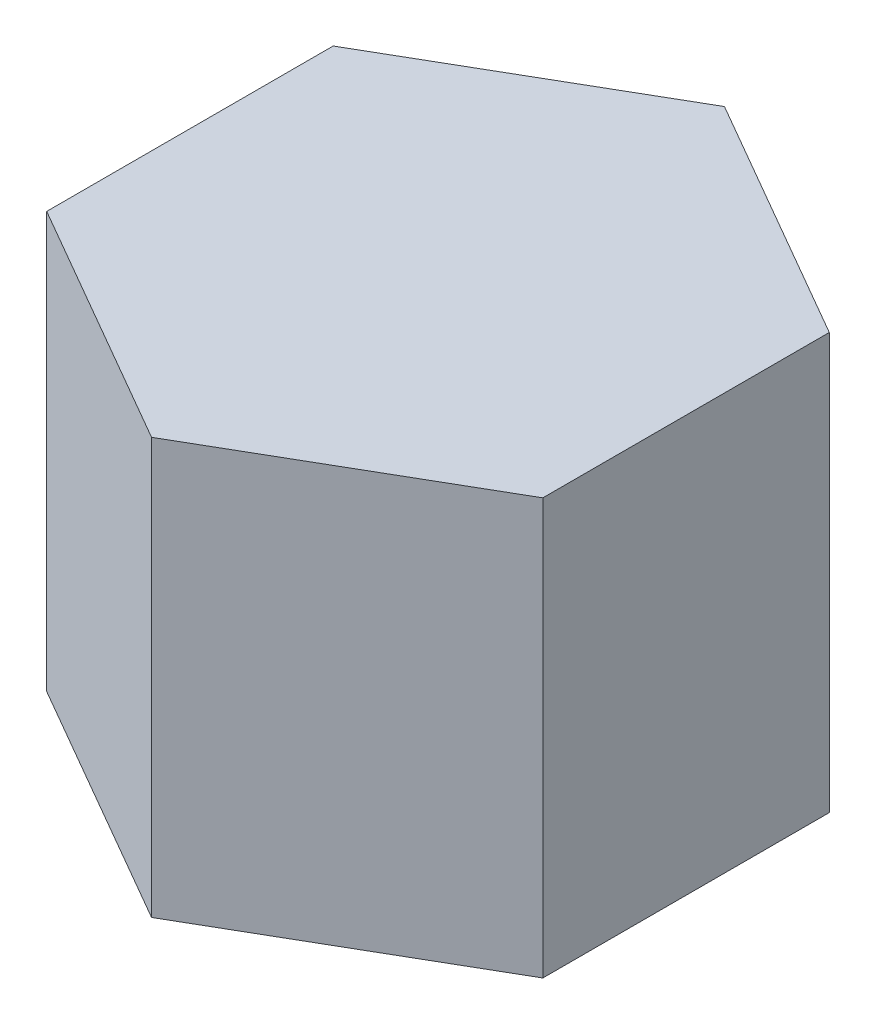
ISO-10303-21;
HEADER;
FILE_DESCRIPTION(('STEP AP214'),'2;1');
FILE_NAME('part.step','',(''),(''),'','','');
FILE_SCHEMA(('AUTOMOTIVE_DESIGN { 1 0 10303 214 1 1 1 1 }'));
ENDSEC;
DATA;
#1=APPLICATION_CONTEXT('core data for automotive mechanical design processes');
#2=APPLICATION_PROTOCOL_DEFINITION('international standard','automotive_design',2000,#1);
#3=PRODUCT_CONTEXT('',#1,'mechanical');
#4=PRODUCT('Part','Part','',(#3));
#5=PRODUCT_RELATED_PRODUCT_CATEGORY('part','',(#4));
#6=PRODUCT_DEFINITION_FORMATION('','',#4);
#7=PRODUCT_DEFINITION_CONTEXT('part definition',#1,'design');
#8=PRODUCT_DEFINITION('design','',#6,#7);
#9=PRODUCT_DEFINITION_SHAPE('','',#8);
#10=(LENGTH_UNIT() NAMED_UNIT(*) SI_UNIT(.MILLI.,.METRE.));
#11=(NAMED_UNIT(*) PLANE_ANGLE_UNIT() SI_UNIT($,.RADIAN.));
#12=(NAMED_UNIT(*) SI_UNIT($,.STERADIAN.) SOLID_ANGLE_UNIT());
#13=UNCERTAINTY_MEASURE_WITH_UNIT(LENGTH_MEASURE(1.E-05),#10,'distance_accuracy_value','');
#14=(GEOMETRIC_REPRESENTATION_CONTEXT(3) GLOBAL_UNCERTAINTY_ASSIGNED_CONTEXT((#13)) GLOBAL_UNIT_ASSIGNED_CONTEXT((#10,
#11,#12)) REPRESENTATION_CONTEXT('',''));
#15=CARTESIAN_POINT('',(0.,0.,0.));
#16=DIRECTION('',(0.,0.,1.));
#17=DIRECTION('',(1.,0.,0.));
#18=AXIS2_PLACEMENT_3D('',#15,#16,#17);
#19=CARTESIAN_POINT('',(205.642660308706,-148.537700895744,293.239022028063));
#20=DIRECTION('',(-0.499999999999909,0.,-0.866025403784491));
#21=DIRECTION('',(-0.866025403784491,0.,0.499999999999909));
#22=AXIS2_PLACEMENT_3D('',#19,#20,#21);
#23=PLANE('',#22);
#24=CARTESIAN_POINT('',(205.339551417382,-149.045793579175,293.414022028063));
#25=DIRECTION('',(0.866025403784491,0.,-0.499999999999909));
#26=VECTOR('',#25,1.);
#27=LINE('',#24,#26);
#28=CARTESIAN_POINT('',(205.339551417382,-149.045793579175,293.414022028063));
#29=VERTEX_POINT('',#28);
#30=CARTESIAN_POINT('',(205.642660308706,-149.045793579175,293.239022028063));
#31=VERTEX_POINT('',#30);
#32=EDGE_CURVE('E170',#29,#31,#27,.T.);
#33=ORIENTED_EDGE('',*,*,#32,.T.);
#34=CARTESIAN_POINT('',(205.642660308706,-148.537700895744,293.239022028063));
#35=DIRECTION('',(0.,-1.,0.));
#36=VECTOR('',#35,1.);
#37=LINE('',#34,#36);
#38=CARTESIAN_POINT('',(205.642660308706,-148.537700895744,293.239022028063));
#39=VERTEX_POINT('',#38);
#40=EDGE_CURVE('E35',#39,#31,#37,.T.);
#41=ORIENTED_EDGE('',*,*,#40,.F.);
#42=CARTESIAN_POINT('',(205.339551417382,-148.537700895744,293.414022028063));
#43=DIRECTION('',(0.866025403784491,0.,-0.499999999999909));
#44=VECTOR('',#43,1.);
#45=LINE('',#42,#44);
#46=CARTESIAN_POINT('',(205.339551417382,-148.537700895744,293.414022028063));
#47=VERTEX_POINT('',#46);
#48=EDGE_CURVE('E159',#47,#39,#45,.T.);
#49=ORIENTED_EDGE('',*,*,#48,.F.);
#50=CARTESIAN_POINT('',(205.339551417382,-148.537700895744,293.414022028063));
#51=DIRECTION('',(0.,-1.,0.));
#52=VECTOR('',#51,1.);
#53=LINE('',#50,#52);
#54=EDGE_CURVE('E10',#47,#29,#53,.T.);
#55=ORIENTED_EDGE('',*,*,#54,.T.);
#56=EDGE_LOOP('',(#33,#41,#49,#55));
#57=FACE_BOUND('',#56,.T.);
#58=ADVANCED_FACE('F16',(#57),#23,.F.);
#59=CARTESIAN_POINT('',(205.339551417382,-148.537700895744,293.414022028063));
#60=DIRECTION('',(0.500000000000062,0.,-0.866025403784403));
#61=DIRECTION('',(-0.866025403784403,0.,-0.500000000000062));
#62=AXIS2_PLACEMENT_3D('',#59,#60,#61);
#63=PLANE('',#62);
#64=CARTESIAN_POINT('',(205.036442526057,-149.045793579175,293.239022028063));
#65=DIRECTION('',(0.866025403784403,0.,0.500000000000062));
#66=VECTOR('',#65,1.);
#67=LINE('',#64,#66);
#68=CARTESIAN_POINT('',(205.036442526057,-149.045793579175,293.239022028063));
#69=VERTEX_POINT('',#68);
#70=EDGE_CURVE('E167',#69,#29,#67,.T.);
#71=ORIENTED_EDGE('',*,*,#70,.T.);
#72=ORIENTED_EDGE('',*,*,#54,.F.);
#73=CARTESIAN_POINT('',(205.036442526057,-148.537700895744,293.239022028063));
#74=DIRECTION('',(0.866025403784403,0.,0.500000000000062));
#75=VECTOR('',#74,1.);
#76=LINE('',#73,#75);
#77=CARTESIAN_POINT('',(205.036442526057,-148.537700895744,293.239022028063));
#78=VERTEX_POINT('',#77);
#79=EDGE_CURVE('E156',#78,#47,#76,.T.);
#80=ORIENTED_EDGE('',*,*,#79,.F.);
#81=CARTESIAN_POINT('',(205.036442526057,-148.537700895744,293.239022028063));
#82=DIRECTION('',(0.,-1.,0.));
#83=VECTOR('',#82,1.);
#84=LINE('',#81,#83);
#85=EDGE_CURVE('E27',#78,#69,#84,.T.);
#86=ORIENTED_EDGE('',*,*,#85,.T.);
#87=EDGE_LOOP('',(#71,#72,#80,#86));
#88=FACE_BOUND('',#87,.T.);
#89=ADVANCED_FACE('F189',(#88),#63,.F.);
#90=CARTESIAN_POINT('',(205.036442526057,-148.537700895744,290.831971220494));
#91=DIRECTION('',(1.,0.,0.));
#92=DIRECTION('',(0.,1.,0.));
#93=AXIS2_PLACEMENT_3D('',#90,#91,#92);
#94=PLANE('',#93);
#95=CARTESIAN_POINT('',(205.036442526057,-149.045793579175,292.889022028063));
#96=DIRECTION('',(0.,0.,1.));
#97=VECTOR('',#96,1.);
#98=LINE('',#95,#97);
#99=CARTESIAN_POINT('',(205.036442526057,-149.045793579175,292.889022028063));
#100=VERTEX_POINT('',#99);
#101=EDGE_CURVE('E163',#100,#69,#98,.T.);
#102=ORIENTED_EDGE('',*,*,#101,.T.);
#103=ORIENTED_EDGE('',*,*,#85,.F.);
#104=CARTESIAN_POINT('',(205.036442526057,-148.537700895744,292.889022028063));
#105=DIRECTION('',(0.,0.,1.));
#106=VECTOR('',#105,1.);
#107=LINE('',#104,#106);
#108=CARTESIAN_POINT('',(205.036442526057,-148.537700895744,292.889022028063));
#109=VERTEX_POINT('',#108);
#110=EDGE_CURVE('E106',#109,#78,#107,.T.);
#111=ORIENTED_EDGE('',*,*,#110,.F.);
#112=CARTESIAN_POINT('',(205.036442526057,-148.537700895744,292.889022028063));
#113=DIRECTION('',(0.,-1.,0.));
#114=VECTOR('',#113,1.);
#115=LINE('',#112,#114);
#116=EDGE_CURVE('E94',#109,#100,#115,.T.);
#117=ORIENTED_EDGE('',*,*,#116,.T.);
#118=EDGE_LOOP('',(#102,#103,#111,#117));
#119=FACE_BOUND('',#118,.T.);
#120=ADVANCED_FACE('F198',(#119),#94,.F.);
#121=CARTESIAN_POINT('',(205.036442526057,-148.537700895744,292.889022028063));
#122=DIRECTION('',(0.499999999999943,0.,0.866025403784472));
#123=DIRECTION('',(0.866025403784472,0.,-0.499999999999943));
#124=AXIS2_PLACEMENT_3D('',#121,#122,#123);
#125=PLANE('',#124);
#126=CARTESIAN_POINT('',(205.339551417382,-149.045793579175,292.714022028063));
#127=DIRECTION('',(-0.866025403784471,0.,0.499999999999943));
#128=VECTOR('',#127,1.);
#129=LINE('',#126,#128);
#130=CARTESIAN_POINT('',(205.339551417382,-149.045793579175,292.714022028063));
#131=VERTEX_POINT('',#130);
#132=EDGE_CURVE('E162',#131,#100,#129,.T.);
#133=ORIENTED_EDGE('',*,*,#132,.T.);
#134=ORIENTED_EDGE('',*,*,#116,.F.);
#135=CARTESIAN_POINT('',(205.339551417382,-148.537700895744,292.714022028063));
#136=DIRECTION('',(-0.866025403784471,0.,0.499999999999943));
#137=VECTOR('',#136,1.);
#138=LINE('',#135,#137);
#139=CARTESIAN_POINT('',(205.339551417382,-148.537700895744,292.714022028063));
#140=VERTEX_POINT('',#139);
#141=EDGE_CURVE('E98',#140,#109,#138,.T.);
#142=ORIENTED_EDGE('',*,*,#141,.F.);
#143=CARTESIAN_POINT('',(205.339551417382,-148.537700895744,292.714022028063));
#144=DIRECTION('',(0.,-1.,0.));
#145=VECTOR('',#144,1.);
#146=LINE('',#143,#145);
#147=EDGE_CURVE('E79',#140,#131,#146,.T.);
#148=ORIENTED_EDGE('',*,*,#147,.T.);
#149=EDGE_LOOP('',(#133,#134,#142,#148));
#150=FACE_BOUND('',#149,.T.);
#151=ADVANCED_FACE('F100',(#150),#125,.F.);
#152=CARTESIAN_POINT('',(205.339551417382,-148.537700895744,292.714022028063));
#153=DIRECTION('',(-0.500000000000096,0.,0.866025403784383));
#154=DIRECTION('',(0.866025403784383,0.,0.500000000000096));
#155=AXIS2_PLACEMENT_3D('',#152,#153,#154);
#156=PLANE('',#155);
#157=CARTESIAN_POINT('',(205.642660308706,-149.045793579175,292.889022028063));
#158=DIRECTION('',(-0.866025403784383,0.,-0.500000000000096));
#159=VECTOR('',#158,1.);
#160=LINE('',#157,#159);
#161=CARTESIAN_POINT('',(205.642660308706,-149.045793579175,292.889022028063));
#162=VERTEX_POINT('',#161);
#163=EDGE_CURVE('E88',#162,#131,#160,.T.);
#164=ORIENTED_EDGE('',*,*,#163,.T.);
#165=ORIENTED_EDGE('',*,*,#147,.F.);
#166=CARTESIAN_POINT('',(205.642660308706,-148.537700895744,292.889022028063));
#167=DIRECTION('',(-0.866025403784383,0.,-0.500000000000096));
#168=VECTOR('',#167,1.);
#169=LINE('',#166,#168);
#170=CARTESIAN_POINT('',(205.642660308706,-148.537700895744,292.889022028063));
#171=VERTEX_POINT('',#170);
#172=EDGE_CURVE('E84',#171,#140,#169,.T.);
#173=ORIENTED_EDGE('',*,*,#172,.F.);
#174=CARTESIAN_POINT('',(205.642660308706,-148.537700895744,292.889022028063));
#175=DIRECTION('',(0.,-1.,0.));
#176=VECTOR('',#175,1.);
#177=LINE('',#174,#176);
#178=EDGE_CURVE('E58',#171,#162,#177,.T.);
#179=ORIENTED_EDGE('',*,*,#178,.T.);
#180=EDGE_LOOP('',(#164,#165,#173,#179));
#181=FACE_BOUND('',#180,.T.);
#182=ADVANCED_FACE('F82',(#181),#156,.F.);
#183=CARTESIAN_POINT('',(205.642660308706,-148.537700895744,290.831971220494));
#184=DIRECTION('',(-1.,0.,0.));
#185=DIRECTION('',(0.,-1.,0.));
#186=AXIS2_PLACEMENT_3D('',#183,#184,#185);
#187=PLANE('',#186);
#188=CARTESIAN_POINT('',(205.642660308706,-149.045793579175,293.239022028063));
#189=DIRECTION('',(0.,0.,-1.));
#190=VECTOR('',#189,1.);
#191=LINE('',#188,#190);
#192=EDGE_CURVE('E160',#31,#162,#191,.T.);
#193=ORIENTED_EDGE('',*,*,#192,.T.);
#194=ORIENTED_EDGE('',*,*,#178,.F.);
#195=CARTESIAN_POINT('',(205.642660308706,-148.537700895744,293.239022028063));
#196=DIRECTION('',(0.,0.,-1.));
#197=VECTOR('',#196,1.);
#198=LINE('',#195,#197);
#199=EDGE_CURVE('E112',#39,#171,#198,.T.);
#200=ORIENTED_EDGE('',*,*,#199,.F.);
#201=ORIENTED_EDGE('',*,*,#40,.T.);
#202=EDGE_LOOP('',(#193,#194,#200,#201));
#203=FACE_BOUND('',#202,.T.);
#204=ADVANCED_FACE('F131',(#203),#187,.F.);
#205=CARTESIAN_POINT('',(206.339551417382,-148.537700895744,290.831971220494));
#206=DIRECTION('',(0.,-1.,0.));
#207=DIRECTION('',(1.,0.,0.));
#208=AXIS2_PLACEMENT_3D('',#205,#206,#207);
#209=PLANE('',#208);
#210=ORIENTED_EDGE('',*,*,#48,.T.);
#211=ORIENTED_EDGE('',*,*,#199,.T.);
#212=ORIENTED_EDGE('',*,*,#172,.T.);
#213=ORIENTED_EDGE('',*,*,#141,.T.);
#214=ORIENTED_EDGE('',*,*,#110,.T.);
#215=ORIENTED_EDGE('',*,*,#79,.T.);
#216=EDGE_LOOP('',(#210,#211,#212,#213,#214,#215));
#217=FACE_BOUND('',#216,.T.);
#218=ADVANCED_FACE('F111',(#217),#209,.F.);
#219=CARTESIAN_POINT('',(206.339551417382,-149.045793579175,290.831971220494));
#220=DIRECTION('',(0.,-1.,0.));
#221=DIRECTION('',(1.,0.,0.));
#222=AXIS2_PLACEMENT_3D('',#219,#220,#221);
#223=PLANE('',#222);
#224=ORIENTED_EDGE('',*,*,#32,.F.);
#225=ORIENTED_EDGE('',*,*,#70,.F.);
#226=ORIENTED_EDGE('',*,*,#101,.F.);
#227=ORIENTED_EDGE('',*,*,#132,.F.);
#228=ORIENTED_EDGE('',*,*,#163,.F.);
#229=ORIENTED_EDGE('',*,*,#192,.F.);
#230=EDGE_LOOP('',(#224,#225,#226,#227,#228,#229));
#231=FACE_BOUND('',#230,.T.);
#232=ADVANCED_FACE('F130',(#231),#223,.T.);
#233=CLOSED_SHELL('',(#58,#89,#120,#151,#182,#204,#218,#232));
#234=MANIFOLD_SOLID_BREP('B1',#233);
#235=ADVANCED_BREP_SHAPE_REPRESENTATION('',(#18,#234),#14);
#236=SHAPE_DEFINITION_REPRESENTATION(#9,#235);
ENDSEC;
END-ISO-10303-21;
